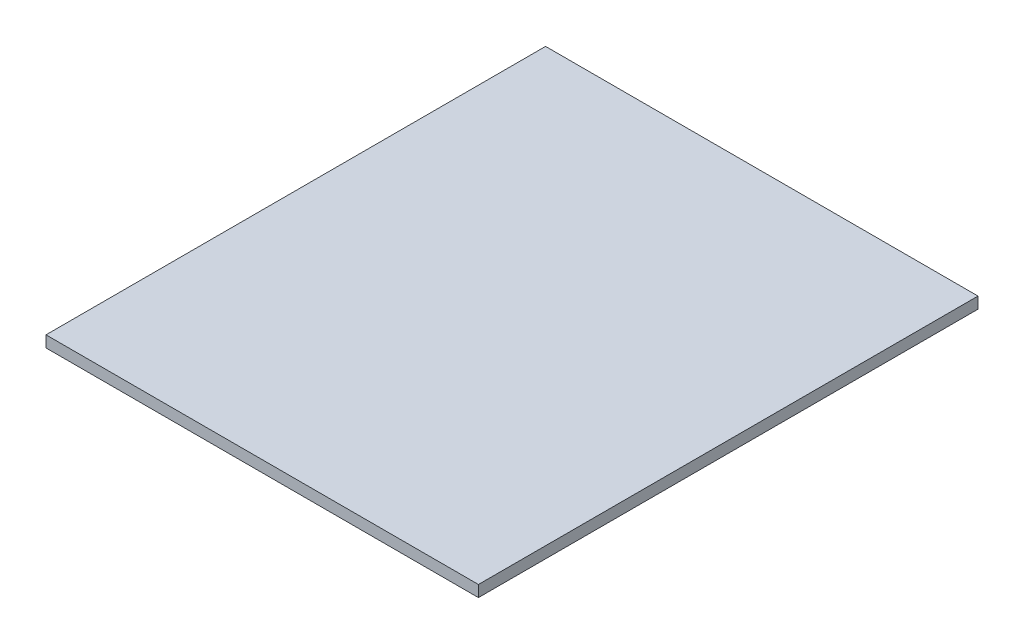
ISO-10303-21;
HEADER;
FILE_DESCRIPTION(('STEP AP214'),'2;1');
FILE_NAME('part.step','',(''),(''),'','','');
FILE_SCHEMA(('AUTOMOTIVE_DESIGN { 1 0 10303 214 1 1 1 1 }'));
ENDSEC;
DATA;
#1=APPLICATION_CONTEXT('core data for automotive mechanical design processes');
#2=APPLICATION_PROTOCOL_DEFINITION('international standard','automotive_design',2000,#1);
#3=PRODUCT_CONTEXT('',#1,'mechanical');
#4=PRODUCT('Part','Part','',(#3));
#5=PRODUCT_RELATED_PRODUCT_CATEGORY('part','',(#4));
#6=PRODUCT_DEFINITION_FORMATION('','',#4);
#7=PRODUCT_DEFINITION_CONTEXT('part definition',#1,'design');
#8=PRODUCT_DEFINITION('design','',#6,#7);
#9=PRODUCT_DEFINITION_SHAPE('','',#8);
#10=(LENGTH_UNIT() NAMED_UNIT(*) SI_UNIT(.MILLI.,.METRE.));
#11=(NAMED_UNIT(*) PLANE_ANGLE_UNIT() SI_UNIT($,.RADIAN.));
#12=(NAMED_UNIT(*) SI_UNIT($,.STERADIAN.) SOLID_ANGLE_UNIT());
#13=UNCERTAINTY_MEASURE_WITH_UNIT(LENGTH_MEASURE(1.E-05),#10,'distance_accuracy_value','');
#14=(GEOMETRIC_REPRESENTATION_CONTEXT(3) GLOBAL_UNCERTAINTY_ASSIGNED_CONTEXT((#13)) GLOBAL_UNIT_ASSIGNED_CONTEXT((#10,
#11,#12)) REPRESENTATION_CONTEXT('',''));
#15=CARTESIAN_POINT('',(0.,0.,0.));
#16=DIRECTION('',(0.,0.,1.));
#17=DIRECTION('',(1.,0.,0.));
#18=AXIS2_PLACEMENT_3D('',#15,#16,#17);
#19=CARTESIAN_POINT('',(190.,10.,219.5));
#20=DIRECTION('',(-1.,0.,0.));
#21=DIRECTION('',(0.,0.,1.));
#22=AXIS2_PLACEMENT_3D('',#19,#20,#21);
#23=PLANE('',#22);
#24=DIRECTION('',(0.,0.,-1.));
#25=VECTOR('',#24,1.);
#26=CARTESIAN_POINT('',(190.,0.,219.5));
#27=LINE('',#26,#25);
#28=CARTESIAN_POINT('',(190.,0.,219.5));
#29=VERTEX_POINT('',#28);
#30=CARTESIAN_POINT('',(190.,0.,-219.5));
#31=VERTEX_POINT('',#30);
#32=EDGE_CURVE('E97',#29,#31,#27,.T.);
#33=ORIENTED_EDGE('',*,*,#32,.T.);
#34=DIRECTION('',(0.,-1.,0.));
#35=VECTOR('',#34,1.);
#36=CARTESIAN_POINT('',(190.,10.,-219.5));
#37=LINE('',#36,#35);
#38=CARTESIAN_POINT('',(190.,10.,-219.5));
#39=VERTEX_POINT('',#38);
#40=EDGE_CURVE('E11',#39,#31,#37,.T.);
#41=ORIENTED_EDGE('',*,*,#40,.F.);
#42=DIRECTION('',(0.,0.,-1.));
#43=VECTOR('',#42,1.);
#44=CARTESIAN_POINT('',(190.,10.,219.5));
#45=LINE('',#44,#43);
#46=CARTESIAN_POINT('',(190.,10.,219.5));
#47=VERTEX_POINT('',#46);
#48=EDGE_CURVE('E85',#47,#39,#45,.T.);
#49=ORIENTED_EDGE('',*,*,#48,.F.);
#50=DIRECTION('',(0.,-1.,0.));
#51=VECTOR('',#50,1.);
#52=CARTESIAN_POINT('',(190.,10.,219.5));
#53=LINE('',#52,#51);
#54=EDGE_CURVE('E93',#47,#29,#53,.T.);
#55=ORIENTED_EDGE('',*,*,#54,.T.);
#56=EDGE_LOOP('',(#33,#41,#49,#55));
#57=FACE_BOUND('',#56,.T.);
#58=ADVANCED_FACE('F34',(#57),#23,.F.);
#59=CARTESIAN_POINT('',(-190.,10.,-219.5));
#60=DIRECTION('',(0.,0.,1.));
#61=DIRECTION('',(1.,0.,0.));
#62=AXIS2_PLACEMENT_3D('',#59,#60,#61);
#63=PLANE('',#62);
#64=DIRECTION('',(-1.,0.,0.));
#65=VECTOR('',#64,1.);
#66=CARTESIAN_POINT('',(-190.,0.,-219.5));
#67=LINE('',#66,#65);
#68=CARTESIAN_POINT('',(-190.,0.,-219.5));
#69=VERTEX_POINT('',#68);
#70=EDGE_CURVE('E89',#31,#69,#67,.T.);
#71=ORIENTED_EDGE('',*,*,#70,.T.);
#72=DIRECTION('',(0.,-1.,0.));
#73=VECTOR('',#72,1.);
#74=CARTESIAN_POINT('',(-190.,10.,-219.5));
#75=LINE('',#74,#73);
#76=CARTESIAN_POINT('',(-190.,10.,-219.5));
#77=VERTEX_POINT('',#76);
#78=EDGE_CURVE('E42',#77,#69,#75,.T.);
#79=ORIENTED_EDGE('',*,*,#78,.F.);
#80=DIRECTION('',(-1.,0.,0.));
#81=VECTOR('',#80,1.);
#82=CARTESIAN_POINT('',(-190.,10.,-219.5));
#83=LINE('',#82,#81);
#84=EDGE_CURVE('E80',#39,#77,#83,.T.);
#85=ORIENTED_EDGE('',*,*,#84,.F.);
#86=ORIENTED_EDGE('',*,*,#40,.T.);
#87=EDGE_LOOP('',(#71,#79,#85,#86));
#88=FACE_BOUND('',#87,.T.);
#89=ADVANCED_FACE('F88',(#88),#63,.F.);
#90=CARTESIAN_POINT('',(-190.,10.,219.5));
#91=DIRECTION('',(1.,0.,0.));
#92=DIRECTION('',(0.,0.,-1.));
#93=AXIS2_PLACEMENT_3D('',#90,#91,#92);
#94=PLANE('',#93);
#95=DIRECTION('',(0.,0.,1.));
#96=VECTOR('',#95,1.);
#97=CARTESIAN_POINT('',(-190.,0.,219.5));
#98=LINE('',#97,#96);
#99=CARTESIAN_POINT('',(-190.,0.,219.5));
#100=VERTEX_POINT('',#99);
#101=EDGE_CURVE('E67',#69,#100,#98,.T.);
#102=ORIENTED_EDGE('',*,*,#101,.T.);
#103=DIRECTION('',(0.,-1.,0.));
#104=VECTOR('',#103,1.);
#105=CARTESIAN_POINT('',(-190.,10.,219.5));
#106=LINE('',#105,#104);
#107=CARTESIAN_POINT('',(-190.,10.,219.5));
#108=VERTEX_POINT('',#107);
#109=EDGE_CURVE('E90',#108,#100,#106,.T.);
#110=ORIENTED_EDGE('',*,*,#109,.F.);
#111=DIRECTION('',(0.,0.,1.));
#112=VECTOR('',#111,1.);
#113=CARTESIAN_POINT('',(-190.,10.,219.5));
#114=LINE('',#113,#112);
#115=EDGE_CURVE('E83',#77,#108,#114,.T.);
#116=ORIENTED_EDGE('',*,*,#115,.F.);
#117=ORIENTED_EDGE('',*,*,#78,.T.);
#118=EDGE_LOOP('',(#102,#110,#116,#117));
#119=FACE_BOUND('',#118,.T.);
#120=ADVANCED_FACE('F91',(#119),#94,.F.);
#121=CARTESIAN_POINT('',(-190.,10.,219.5));
#122=DIRECTION('',(0.,0.,-1.));
#123=DIRECTION('',(-1.,0.,0.));
#124=AXIS2_PLACEMENT_3D('',#121,#122,#123);
#125=PLANE('',#124);
#126=DIRECTION('',(1.,0.,0.));
#127=VECTOR('',#126,1.);
#128=CARTESIAN_POINT('',(-190.,0.,219.5));
#129=LINE('',#128,#127);
#130=EDGE_CURVE('E73',#100,#29,#129,.T.);
#131=ORIENTED_EDGE('',*,*,#130,.T.);
#132=ORIENTED_EDGE('',*,*,#54,.F.);
#133=DIRECTION('',(1.,0.,0.));
#134=VECTOR('',#133,1.);
#135=CARTESIAN_POINT('',(-190.,10.,219.5));
#136=LINE('',#135,#134);
#137=EDGE_CURVE('E50',#108,#47,#136,.T.);
#138=ORIENTED_EDGE('',*,*,#137,.F.);
#139=ORIENTED_EDGE('',*,*,#109,.T.);
#140=EDGE_LOOP('',(#131,#132,#138,#139));
#141=FACE_BOUND('',#140,.T.);
#142=ADVANCED_FACE('F104',(#141),#125,.F.);
#143=CARTESIAN_POINT('',(0.,10.,0.));
#144=DIRECTION('',(0.,-1.,0.));
#145=DIRECTION('',(0.,0.,-1.));
#146=AXIS2_PLACEMENT_3D('',#143,#144,#145);
#147=PLANE('',#146);
#148=ORIENTED_EDGE('',*,*,#48,.T.);
#149=ORIENTED_EDGE('',*,*,#84,.T.);
#150=ORIENTED_EDGE('',*,*,#115,.T.);
#151=ORIENTED_EDGE('',*,*,#137,.T.);
#152=EDGE_LOOP('',(#148,#149,#150,#151));
#153=FACE_BOUND('',#152,.T.);
#154=ADVANCED_FACE('F81',(#153),#147,.F.);
#155=CARTESIAN_POINT('',(0.,0.,0.));
#156=DIRECTION('',(0.,-1.,0.));
#157=DIRECTION('',(0.,0.,-1.));
#158=AXIS2_PLACEMENT_3D('',#155,#156,#157);
#159=PLANE('',#158);
#160=ORIENTED_EDGE('',*,*,#32,.F.);
#161=ORIENTED_EDGE('',*,*,#130,.F.);
#162=ORIENTED_EDGE('',*,*,#101,.F.);
#163=ORIENTED_EDGE('',*,*,#70,.F.);
#164=EDGE_LOOP('',(#160,#161,#162,#163));
#165=FACE_BOUND('',#164,.T.);
#166=ADVANCED_FACE('F107',(#165),#159,.T.);
#167=CLOSED_SHELL('',(#58,#89,#120,#142,#154,#166));
#168=MANIFOLD_SOLID_BREP('B2',#167);
#169=ADVANCED_BREP_SHAPE_REPRESENTATION('',(#18,#168),#14);
#170=SHAPE_DEFINITION_REPRESENTATION(#9,#169);
ENDSEC;
END-ISO-10303-21;
